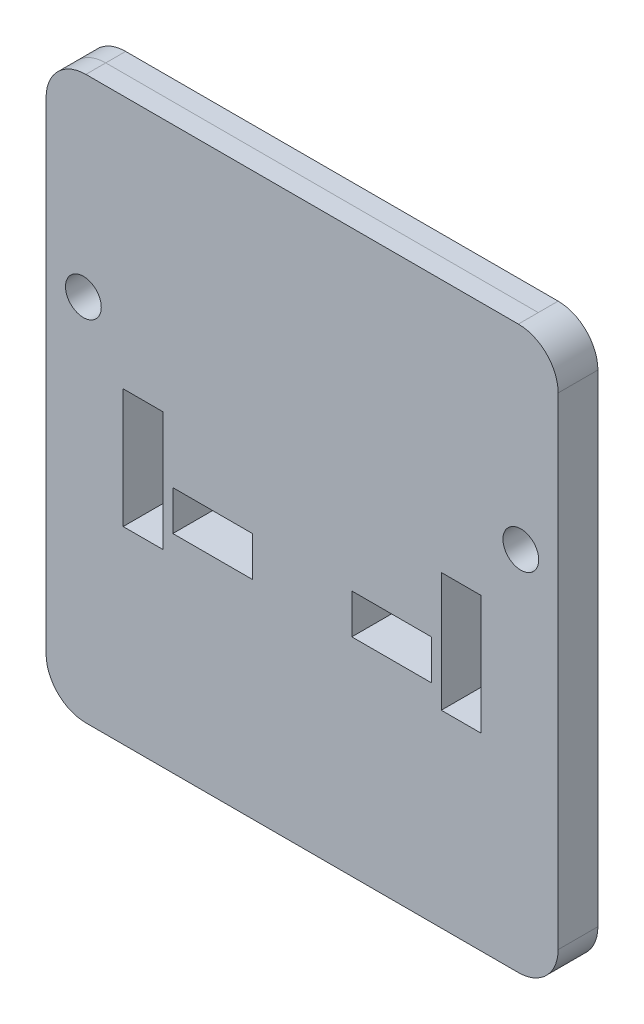
ISO-10303-21;
HEADER;
FILE_DESCRIPTION(('STEP AP214'),'2;1');
FILE_NAME('part.step','',(''),(''),'','','');
FILE_SCHEMA(('AUTOMOTIVE_DESIGN { 1 0 10303 214 1 1 1 1 }'));
ENDSEC;
DATA;
#1=APPLICATION_CONTEXT('core data for automotive mechanical design processes');
#2=APPLICATION_PROTOCOL_DEFINITION('international standard','automotive_design',2000,#1);
#3=PRODUCT_CONTEXT('',#1,'mechanical');
#4=PRODUCT('Part','Part','',(#3));
#5=PRODUCT_RELATED_PRODUCT_CATEGORY('part','',(#4));
#6=PRODUCT_DEFINITION_FORMATION('','',#4);
#7=PRODUCT_DEFINITION_CONTEXT('part definition',#1,'design');
#8=PRODUCT_DEFINITION('design','',#6,#7);
#9=PRODUCT_DEFINITION_SHAPE('','',#8);
#10=(LENGTH_UNIT() NAMED_UNIT(*) SI_UNIT(.MILLI.,.METRE.));
#11=(NAMED_UNIT(*) PLANE_ANGLE_UNIT() SI_UNIT($,.RADIAN.));
#12=(NAMED_UNIT(*) SI_UNIT($,.STERADIAN.) SOLID_ANGLE_UNIT());
#13=UNCERTAINTY_MEASURE_WITH_UNIT(LENGTH_MEASURE(1.E-05),#10,'distance_accuracy_value','');
#14=(GEOMETRIC_REPRESENTATION_CONTEXT(3) GLOBAL_UNCERTAINTY_ASSIGNED_CONTEXT((#13)) GLOBAL_UNIT_ASSIGNED_CONTEXT((#10,
#11,#12)) REPRESENTATION_CONTEXT('',''));
#15=CARTESIAN_POINT('',(0.,0.,0.));
#16=DIRECTION('',(0.,0.,1.));
#17=DIRECTION('',(1.,0.,0.));
#18=AXIS2_PLACEMENT_3D('',#15,#16,#17);
#19=CARTESIAN_POINT('',(-138.113003809,-179.355296356,25.4));
#20=DIRECTION('',(0.,1.,0.));
#21=DIRECTION('',(0.,0.,1.));
#22=AXIS2_PLACEMENT_3D('',#19,#20,#21);
#23=PLANE('',#22);
#24=DIRECTION('',(0.,0.,-1.));
#25=VECTOR('',#24,1.);
#26=CARTESIAN_POINT('',(-138.113003809,-179.355296356,25.4));
#27=LINE('',#26,#25);
#28=CARTESIAN_POINT('',(-138.113003809,-179.355296356,25.4));
#29=VERTEX_POINT('',#28);
#30=CARTESIAN_POINT('',(-138.113003809,-179.355296356,12.7));
#31=VERTEX_POINT('',#30);
#32=EDGE_CURVE('E430',#29,#31,#27,.T.);
#33=ORIENTED_EDGE('',*,*,#32,.T.);
#34=DIRECTION('',(1.,0.,0.));
#35=VECTOR('',#34,1.);
#36=CARTESIAN_POINT('',(-138.113003809,-179.355296356,12.7));
#37=LINE('',#36,#35);
#38=CARTESIAN_POINT('',(138.113003809,-179.355296356,12.7));
#39=VERTEX_POINT('',#38);
#40=EDGE_CURVE('E12',#31,#39,#37,.T.);
#41=ORIENTED_EDGE('',*,*,#40,.T.);
#42=DIRECTION('',(0.,0.,-1.));
#43=VECTOR('',#42,1.);
#44=CARTESIAN_POINT('',(138.113003809,-179.355296356,25.4));
#45=LINE('',#44,#43);
#46=CARTESIAN_POINT('',(138.113003809,-179.355296356,25.4));
#47=VERTEX_POINT('',#46);
#48=EDGE_CURVE('E426',#47,#39,#45,.T.);
#49=ORIENTED_EDGE('',*,*,#48,.F.);
#50=DIRECTION('',(1.,0.,0.));
#51=VECTOR('',#50,1.);
#52=CARTESIAN_POINT('',(-138.113003809,-179.355296356,25.4));
#53=LINE('',#52,#51);
#54=EDGE_CURVE('E368',#29,#47,#53,.T.);
#55=ORIENTED_EDGE('',*,*,#54,.F.);
#56=EDGE_LOOP('',(#33,#41,#49,#55));
#57=FACE_BOUND('',#56,.T.);
#58=ADVANCED_FACE('F40',(#57),#23,.F.);
#59=CARTESIAN_POINT('',(-138.113003809,-153.955296356,25.4));
#60=DIRECTION('',(0.,0.,-1.));
#61=DIRECTION('',(-1.,0.,0.));
#62=AXIS2_PLACEMENT_3D('',#59,#60,#61);
#63=CYLINDRICAL_SURFACE('',#62,25.4);
#64=DIRECTION('',(0.,0.,-1.));
#65=VECTOR('',#64,1.);
#66=CARTESIAN_POINT('',(-163.513003809,-153.955296356,25.4));
#67=LINE('',#66,#65);
#68=CARTESIAN_POINT('',(-163.513003809,-153.955296356,25.4));
#69=VERTEX_POINT('',#68);
#70=CARTESIAN_POINT('',(-163.513003809,-153.955296356,12.7));
#71=VERTEX_POINT('',#70);
#72=EDGE_CURVE('E404',#69,#71,#67,.T.);
#73=ORIENTED_EDGE('',*,*,#72,.T.);
#74=CARTESIAN_POINT('',(-138.113003809,-153.955296356,12.7));
#75=DIRECTION('',(0.,0.,1.));
#76=DIRECTION('',(1.,0.,0.));
#77=AXIS2_PLACEMENT_3D('',#74,#75,#76);
#78=CIRCLE('',#77,25.4);
#79=EDGE_CURVE('E48',#71,#31,#78,.T.);
#80=ORIENTED_EDGE('',*,*,#79,.T.);
#81=ORIENTED_EDGE('',*,*,#32,.F.);
#82=CARTESIAN_POINT('',(-138.113003809,-153.955296356,25.4));
#83=DIRECTION('',(0.,0.,1.));
#84=DIRECTION('',(-1.,0.,0.));
#85=AXIS2_PLACEMENT_3D('',#82,#83,#84);
#86=CIRCLE('',#85,25.4);
#87=EDGE_CURVE('E365',#69,#29,#86,.T.);
#88=ORIENTED_EDGE('',*,*,#87,.F.);
#89=EDGE_LOOP('',(#73,#80,#81,#88));
#90=FACE_BOUND('',#89,.T.);
#91=ADVANCED_FACE('F444',(#90),#63,.T.);
#92=CARTESIAN_POINT('',(-138.113003809,153.955296356,25.4));
#93=DIRECTION('',(0.,0.,-1.));
#94=DIRECTION('',(-1.,0.,0.));
#95=AXIS2_PLACEMENT_3D('',#92,#93,#94);
#96=CYLINDRICAL_SURFACE('',#95,25.4);
#97=DIRECTION('',(0.,0.,-1.));
#98=VECTOR('',#97,1.);
#99=CARTESIAN_POINT('',(-138.113003809,179.355296356,25.4));
#100=LINE('',#99,#98);
#101=CARTESIAN_POINT('',(-138.113003809,179.355296356,25.4));
#102=VERTEX_POINT('',#101);
#103=CARTESIAN_POINT('',(-138.113003809,179.355296356,12.7));
#104=VERTEX_POINT('',#103);
#105=EDGE_CURVE('E412',#102,#104,#100,.T.);
#106=ORIENTED_EDGE('',*,*,#105,.T.);
#107=CARTESIAN_POINT('',(-138.113003809,153.955296356,12.7));
#108=DIRECTION('',(0.,0.,1.));
#109=DIRECTION('',(1.,0.,0.));
#110=AXIS2_PLACEMENT_3D('',#107,#108,#109);
#111=CIRCLE('',#110,25.4);
#112=CARTESIAN_POINT('',(-163.513003809,153.955296356,12.7));
#113=VERTEX_POINT('',#112);
#114=EDGE_CURVE('E439',#104,#113,#111,.T.);
#115=ORIENTED_EDGE('',*,*,#114,.T.);
#116=DIRECTION('',(0.,0.,-1.));
#117=VECTOR('',#116,1.);
#118=CARTESIAN_POINT('',(-163.513003809,153.955296356,25.4));
#119=LINE('',#118,#117);
#120=CARTESIAN_POINT('',(-163.513003809,153.955296356,25.4));
#121=VERTEX_POINT('',#120);
#122=EDGE_CURVE('E408',#121,#113,#119,.T.);
#123=ORIENTED_EDGE('',*,*,#122,.F.);
#124=CARTESIAN_POINT('',(-138.113003809,153.955296356,25.4));
#125=DIRECTION('',(0.,0.,1.));
#126=DIRECTION('',(-1.,0.,0.));
#127=AXIS2_PLACEMENT_3D('',#124,#125,#126);
#128=CIRCLE('',#127,25.4);
#129=EDGE_CURVE('E379',#102,#121,#128,.T.);
#130=ORIENTED_EDGE('',*,*,#129,.F.);
#131=EDGE_LOOP('',(#106,#115,#123,#130));
#132=FACE_BOUND('',#131,.T.);
#133=ADVANCED_FACE('F494',(#132),#96,.T.);
#134=CARTESIAN_POINT('',(-163.513003809,-153.955296356,25.4));
#135=DIRECTION('',(1.,0.,0.));
#136=DIRECTION('',(0.,0.,-1.));
#137=AXIS2_PLACEMENT_3D('',#134,#135,#136);
#138=PLANE('',#137);
#139=ORIENTED_EDGE('',*,*,#122,.T.);
#140=DIRECTION('',(0.,-1.,0.));
#141=VECTOR('',#140,1.);
#142=CARTESIAN_POINT('',(-163.513003809,-153.955296356,12.7));
#143=LINE('',#142,#141);
#144=EDGE_CURVE('E436',#113,#71,#143,.T.);
#145=ORIENTED_EDGE('',*,*,#144,.T.);
#146=ORIENTED_EDGE('',*,*,#72,.F.);
#147=DIRECTION('',(0.,-1.,0.));
#148=VECTOR('',#147,1.);
#149=CARTESIAN_POINT('',(-163.513003809,-153.955296356,25.4));
#150=LINE('',#149,#148);
#151=EDGE_CURVE('E381',#121,#69,#150,.T.);
#152=ORIENTED_EDGE('',*,*,#151,.F.);
#153=EDGE_LOOP('',(#139,#145,#146,#152));
#154=FACE_BOUND('',#153,.T.);
#155=ADVANCED_FACE('F461',(#154),#138,.F.);
#156=CARTESIAN_POINT('',(-138.113003809,179.355296356,25.4));
#157=DIRECTION('',(0.,-1.,0.));
#158=DIRECTION('',(0.,0.,-1.));
#159=AXIS2_PLACEMENT_3D('',#156,#157,#158);
#160=PLANE('',#159);
#161=DIRECTION('',(0.,0.,-1.));
#162=VECTOR('',#161,1.);
#163=CARTESIAN_POINT('',(138.113003809,179.355296356,25.4));
#164=LINE('',#163,#162);
#165=CARTESIAN_POINT('',(138.113003809,179.355296356,25.4));
#166=VERTEX_POINT('',#165);
#167=CARTESIAN_POINT('',(138.113003809,179.355296356,12.7));
#168=VERTEX_POINT('',#167);
#169=EDGE_CURVE('E416',#166,#168,#164,.T.);
#170=ORIENTED_EDGE('',*,*,#169,.T.);
#171=DIRECTION('',(-1.,0.,0.));
#172=VECTOR('',#171,1.);
#173=CARTESIAN_POINT('',(-138.113003809,179.355296356,12.7));
#174=LINE('',#173,#172);
#175=EDGE_CURVE('E433',#168,#104,#174,.T.);
#176=ORIENTED_EDGE('',*,*,#175,.T.);
#177=ORIENTED_EDGE('',*,*,#105,.F.);
#178=DIRECTION('',(-1.,0.,0.));
#179=VECTOR('',#178,1.);
#180=CARTESIAN_POINT('',(-138.113003809,179.355296356,25.4));
#181=LINE('',#180,#179);
#182=EDGE_CURVE('E377',#166,#102,#181,.T.);
#183=ORIENTED_EDGE('',*,*,#182,.F.);
#184=EDGE_LOOP('',(#170,#176,#177,#183));
#185=FACE_BOUND('',#184,.T.);
#186=ADVANCED_FACE('F491',(#185),#160,.F.);
#187=CARTESIAN_POINT('',(-138.113003809,-153.955296356,25.4));
#188=DIRECTION('',(0.,0.,-1.));
#189=DIRECTION('',(-1.,0.,0.));
#190=AXIS2_PLACEMENT_3D('',#187,#188,#189);
#191=PLANE('',#190);
#192=DIRECTION('',(0.,-1.,0.));
#193=VECTOR('',#192,1.);
#194=CARTESIAN_POINT('',(114.3,17.3557557379995,25.4));
#195=LINE('',#194,#193);
#196=CARTESIAN_POINT('',(114.3,17.3557557379995,25.4));
#197=VERTEX_POINT('',#196);
#198=CARTESIAN_POINT('',(114.3,-58.8442442620005,25.4));
#199=VERTEX_POINT('',#198);
#200=EDGE_CURVE('E230',#197,#199,#195,.T.);
#201=ORIENTED_EDGE('',*,*,#200,.T.);
#202=DIRECTION('',(-1.,0.,0.));
#203=VECTOR('',#202,1.);
#204=CARTESIAN_POINT('',(114.3,-58.8442442620005,25.4));
#205=LINE('',#204,#203);
#206=CARTESIAN_POINT('',(88.9000000000001,-58.8442442620005,25.4));
#207=VERTEX_POINT('',#206);
#208=EDGE_CURVE('E222',#199,#207,#205,.T.);
#209=ORIENTED_EDGE('',*,*,#208,.T.);
#210=DIRECTION('',(0.,1.,0.));
#211=VECTOR('',#210,1.);
#212=CARTESIAN_POINT('',(88.9000000000001,-58.8442442620005,25.4));
#213=LINE('',#212,#211);
#214=CARTESIAN_POINT('',(88.9000000000001,17.3557557379995,25.4));
#215=VERTEX_POINT('',#214);
#216=EDGE_CURVE('E233',#207,#215,#213,.T.);
#217=ORIENTED_EDGE('',*,*,#216,.T.);
#218=DIRECTION('',(1.,0.,0.));
#219=VECTOR('',#218,1.);
#220=CARTESIAN_POINT('',(88.9000000000001,17.3557557379995,25.4));
#221=LINE('',#220,#219);
#222=EDGE_CURVE('E55',#215,#197,#221,.T.);
#223=ORIENTED_EDGE('',*,*,#222,.T.);
#224=EDGE_LOOP('',(#201,#209,#217,#223));
#225=FACE_BOUND('',#224,.T.);
#226=DIRECTION('',(0.,-1.,0.));
#227=VECTOR('',#226,1.);
#228=CARTESIAN_POINT('',(-88.8999999999999,17.3557557379998,25.4));
#229=LINE('',#228,#227);
#230=CARTESIAN_POINT('',(-88.8999999999999,17.3557557379998,25.4));
#231=VERTEX_POINT('',#230);
#232=CARTESIAN_POINT('',(-88.8999999999999,-58.8442442620002,25.4));
#233=VERTEX_POINT('',#232);
#234=EDGE_CURVE('E263',#231,#233,#229,.T.);
#235=ORIENTED_EDGE('',*,*,#234,.T.);
#236=DIRECTION('',(-1.,0.,0.));
#237=VECTOR('',#236,1.);
#238=CARTESIAN_POINT('',(-88.8999999999999,-58.8442442620002,25.4));
#239=LINE('',#238,#237);
#240=CARTESIAN_POINT('',(-114.3,-58.8442442620002,25.4));
#241=VERTEX_POINT('',#240);
#242=EDGE_CURVE('E274',#233,#241,#239,.T.);
#243=ORIENTED_EDGE('',*,*,#242,.T.);
#244=DIRECTION('',(0.,1.,0.));
#245=VECTOR('',#244,1.);
#246=CARTESIAN_POINT('',(-114.3,-58.8442442620002,25.4));
#247=LINE('',#246,#245);
#248=CARTESIAN_POINT('',(-114.3,17.3557557379998,25.4));
#249=VERTEX_POINT('',#248);
#250=EDGE_CURVE('E284',#241,#249,#247,.T.);
#251=ORIENTED_EDGE('',*,*,#250,.T.);
#252=DIRECTION('',(1.,0.,0.));
#253=VECTOR('',#252,1.);
#254=CARTESIAN_POINT('',(-114.3,17.3557557379998,25.4));
#255=LINE('',#254,#253);
#256=EDGE_CURVE('E63',#249,#231,#255,.T.);
#257=ORIENTED_EDGE('',*,*,#256,.T.);
#258=EDGE_LOOP('',(#235,#243,#251,#257));
#259=FACE_BOUND('',#258,.T.);
#260=DIRECTION('',(1.,0.,0.));
#261=VECTOR('',#260,1.);
#262=CARTESIAN_POINT('',(31.7500000000001,-21.4341674440001,25.4));
#263=LINE('',#262,#261);
#264=CARTESIAN_POINT('',(31.7500000000001,-21.4341674440001,25.4));
#265=VERTEX_POINT('',#264);
#266=CARTESIAN_POINT('',(82.5500000000001,-21.4341674440001,25.4));
#267=VERTEX_POINT('',#266);
#268=EDGE_CURVE('E299',#265,#267,#263,.T.);
#269=ORIENTED_EDGE('',*,*,#268,.T.);
#270=DIRECTION('',(0.,-1.,0.));
#271=VECTOR('',#270,1.);
#272=CARTESIAN_POINT('',(82.5500000000001,-21.4341674440001,25.4));
#273=LINE('',#272,#271);
#274=CARTESIAN_POINT('',(82.5500000000001,-46.8341674440001,25.4));
#275=VERTEX_POINT('',#274);
#276=EDGE_CURVE('E289',#267,#275,#273,.T.);
#277=ORIENTED_EDGE('',*,*,#276,.T.);
#278=DIRECTION('',(-1.,0.,0.));
#279=VECTOR('',#278,1.);
#280=CARTESIAN_POINT('',(82.5500000000001,-46.8341674440001,25.4));
#281=LINE('',#280,#279);
#282=CARTESIAN_POINT('',(31.7500000000001,-46.8341674440001,25.4));
#283=VERTEX_POINT('',#282);
#284=EDGE_CURVE('E292',#275,#283,#281,.T.);
#285=ORIENTED_EDGE('',*,*,#284,.T.);
#286=DIRECTION('',(0.,1.,0.));
#287=VECTOR('',#286,1.);
#288=CARTESIAN_POINT('',(31.7500000000001,-46.8341674440001,25.4));
#289=LINE('',#288,#287);
#290=EDGE_CURVE('E296',#283,#265,#289,.T.);
#291=ORIENTED_EDGE('',*,*,#290,.T.);
#292=EDGE_LOOP('',(#269,#277,#285,#291));
#293=FACE_BOUND('',#292,.T.);
#294=DIRECTION('',(1.,0.,0.));
#295=VECTOR('',#294,1.);
#296=CARTESIAN_POINT('',(-82.5499999999999,-21.4341674440001,25.4));
#297=LINE('',#296,#295);
#298=CARTESIAN_POINT('',(-82.5499999999999,-21.4341674440001,25.4));
#299=VERTEX_POINT('',#298);
#300=CARTESIAN_POINT('',(-31.7499999999999,-21.4341674440001,25.4));
#301=VERTEX_POINT('',#300);
#302=EDGE_CURVE('E326',#299,#301,#297,.T.);
#303=ORIENTED_EDGE('',*,*,#302,.T.);
#304=DIRECTION('',(0.,-1.,0.));
#305=VECTOR('',#304,1.);
#306=CARTESIAN_POINT('',(-31.7499999999999,-21.4341674440001,25.4));
#307=LINE('',#306,#305);
#308=CARTESIAN_POINT('',(-31.7499999999999,-46.8341674440001,25.4));
#309=VERTEX_POINT('',#308);
#310=EDGE_CURVE('E336',#301,#309,#307,.T.);
#311=ORIENTED_EDGE('',*,*,#310,.T.);
#312=DIRECTION('',(-1.,0.,0.));
#313=VECTOR('',#312,1.);
#314=CARTESIAN_POINT('',(-31.7499999999999,-46.8341674440001,25.4));
#315=LINE('',#314,#313);
#316=CARTESIAN_POINT('',(-82.5499999999999,-46.8341674440001,25.4));
#317=VERTEX_POINT('',#316);
#318=EDGE_CURVE('E348',#309,#317,#315,.T.);
#319=ORIENTED_EDGE('',*,*,#318,.T.);
#320=DIRECTION('',(0.,1.,0.));
#321=VECTOR('',#320,1.);
#322=CARTESIAN_POINT('',(-82.5499999999999,-46.8341674440001,25.4));
#323=LINE('',#322,#321);
#324=EDGE_CURVE('E345',#317,#299,#323,.T.);
#325=ORIENTED_EDGE('',*,*,#324,.T.);
#326=EDGE_LOOP('',(#303,#311,#319,#325));
#327=FACE_BOUND('',#326,.T.);
#328=ORIENTED_EDGE('',*,*,#87,.T.);
#329=ORIENTED_EDGE('',*,*,#54,.T.);
#330=CARTESIAN_POINT('',(138.113003809,-153.955296356,25.4));
#331=DIRECTION('',(0.,0.,1.));
#332=DIRECTION('',(1.,0.,0.));
#333=AXIS2_PLACEMENT_3D('',#330,#331,#332);
#334=CIRCLE('',#333,25.4);
#335=CARTESIAN_POINT('',(163.513003809,-153.955296356,25.4));
#336=VERTEX_POINT('',#335);
#337=EDGE_CURVE('E371',#47,#336,#334,.T.);
#338=ORIENTED_EDGE('',*,*,#337,.T.);
#339=DIRECTION('',(0.,1.,0.));
#340=VECTOR('',#339,1.);
#341=CARTESIAN_POINT('',(163.513003809,-153.955296356,25.4));
#342=LINE('',#341,#340);
#343=CARTESIAN_POINT('',(163.513003809,153.955296356,25.4));
#344=VERTEX_POINT('',#343);
#345=EDGE_CURVE('E373',#336,#344,#342,.T.);
#346=ORIENTED_EDGE('',*,*,#345,.T.);
#347=CARTESIAN_POINT('',(138.113003809,153.955296356,25.4));
#348=DIRECTION('',(0.,0.,1.));
#349=DIRECTION('',(-1.,0.,0.));
#350=AXIS2_PLACEMENT_3D('',#347,#348,#349);
#351=CIRCLE('',#350,25.4);
#352=EDGE_CURVE('E375',#344,#166,#351,.T.);
#353=ORIENTED_EDGE('',*,*,#352,.T.);
#354=ORIENTED_EDGE('',*,*,#182,.T.);
#355=ORIENTED_EDGE('',*,*,#129,.T.);
#356=ORIENTED_EDGE('',*,*,#151,.T.);
#357=EDGE_LOOP('',(#328,#329,#338,#346,#353,#354,#355,#356));
#358=FACE_BOUND('',#357,.T.);
#359=CARTESIAN_POINT('',(-139.7,55.455755738,25.4));
#360=DIRECTION('',(0.,0.,1.));
#361=DIRECTION('',(1.,0.,0.));
#362=AXIS2_PLACEMENT_3D('',#359,#360,#361);
#363=CIRCLE('',#362,11.422);
#364=CARTESIAN_POINT('',(-128.278,55.455755738,25.4));
#365=VERTEX_POINT('',#364);
#366=EDGE_CURVE('E359',#365,#365,#363,.T.);
#367=ORIENTED_EDGE('',*,*,#366,.F.);
#368=EDGE_LOOP('',(#367));
#369=FACE_BOUND('',#368,.T.);
#370=CARTESIAN_POINT('',(139.7,55.455755738,25.4));
#371=DIRECTION('',(0.,0.,1.));
#372=DIRECTION('',(1.,0.,0.));
#373=AXIS2_PLACEMENT_3D('',#370,#371,#372);
#374=CIRCLE('',#373,11.422);
#375=CARTESIAN_POINT('',(151.122,55.455755738,25.4));
#376=VERTEX_POINT('',#375);
#377=EDGE_CURVE('E353',#376,#376,#374,.T.);
#378=ORIENTED_EDGE('',*,*,#377,.F.);
#379=EDGE_LOOP('',(#378));
#380=FACE_BOUND('',#379,.T.);
#381=ADVANCED_FACE('F237',(#225,#259,#293,#327,#358,#369,#380),#191,.F.);
#382=CARTESIAN_POINT('',(-138.113003809,-153.955296356,0.));
#383=DIRECTION('',(0.,0.,-1.));
#384=DIRECTION('',(-1.,0.,0.));
#385=AXIS2_PLACEMENT_3D('',#382,#383,#384);
#386=PLANE('',#385);
#387=DIRECTION('',(-1.,0.,0.));
#388=VECTOR('',#387,1.);
#389=CARTESIAN_POINT('',(114.3,-58.8442442620005,0.));
#390=LINE('',#389,#388);
#391=CARTESIAN_POINT('',(114.3,-58.8442442620005,0.));
#392=VERTEX_POINT('',#391);
#393=CARTESIAN_POINT('',(88.9000000000001,-58.8442442620005,0.));
#394=VERTEX_POINT('',#393);
#395=EDGE_CURVE('E225',#392,#394,#390,.T.);
#396=ORIENTED_EDGE('',*,*,#395,.F.);
#397=DIRECTION('',(0.,-1.,0.));
#398=VECTOR('',#397,1.);
#399=CARTESIAN_POINT('',(114.3,17.3557557379995,0.));
#400=LINE('',#399,#398);
#401=CARTESIAN_POINT('',(114.3,17.3557557379995,0.));
#402=VERTEX_POINT('',#401);
#403=EDGE_CURVE('E240',#402,#392,#400,.T.);
#404=ORIENTED_EDGE('',*,*,#403,.F.);
#405=DIRECTION('',(1.,0.,0.));
#406=VECTOR('',#405,1.);
#407=CARTESIAN_POINT('',(88.9000000000001,17.3557557379995,0.));
#408=LINE('',#407,#406);
#409=CARTESIAN_POINT('',(88.9000000000001,17.3557557379995,0.));
#410=VERTEX_POINT('',#409);
#411=EDGE_CURVE('E243',#410,#402,#408,.T.);
#412=ORIENTED_EDGE('',*,*,#411,.F.);
#413=DIRECTION('',(0.,1.,0.));
#414=VECTOR('',#413,1.);
#415=CARTESIAN_POINT('',(88.9000000000001,-58.8442442620005,0.));
#416=LINE('',#415,#414);
#417=EDGE_CURVE('E249',#394,#410,#416,.T.);
#418=ORIENTED_EDGE('',*,*,#417,.F.);
#419=EDGE_LOOP('',(#396,#404,#412,#418));
#420=FACE_BOUND('',#419,.T.);
#421=DIRECTION('',(-1.,0.,0.));
#422=VECTOR('',#421,1.);
#423=CARTESIAN_POINT('',(-88.8999999999999,-58.8442442620002,0.));
#424=LINE('',#423,#422);
#425=CARTESIAN_POINT('',(-88.8999999999999,-58.8442442620002,0.));
#426=VERTEX_POINT('',#425);
#427=CARTESIAN_POINT('',(-114.3,-58.8442442620002,0.));
#428=VERTEX_POINT('',#427);
#429=EDGE_CURVE('E250',#426,#428,#424,.T.);
#430=ORIENTED_EDGE('',*,*,#429,.F.);
#431=DIRECTION('',(0.,-1.,0.));
#432=VECTOR('',#431,1.);
#433=CARTESIAN_POINT('',(-88.8999999999999,17.3557557379998,0.));
#434=LINE('',#433,#432);
#435=CARTESIAN_POINT('',(-88.8999999999999,17.3557557379998,0.));
#436=VERTEX_POINT('',#435);
#437=EDGE_CURVE('E270',#436,#426,#434,.T.);
#438=ORIENTED_EDGE('',*,*,#437,.F.);
#439=DIRECTION('',(1.,0.,0.));
#440=VECTOR('',#439,1.);
#441=CARTESIAN_POINT('',(-114.3,17.3557557379998,0.));
#442=LINE('',#441,#440);
#443=CARTESIAN_POINT('',(-114.3,17.3557557379998,0.));
#444=VERTEX_POINT('',#443);
#445=EDGE_CURVE('E273',#444,#436,#442,.T.);
#446=ORIENTED_EDGE('',*,*,#445,.F.);
#447=DIRECTION('',(0.,1.,0.));
#448=VECTOR('',#447,1.);
#449=CARTESIAN_POINT('',(-114.3,-58.8442442620002,0.));
#450=LINE('',#449,#448);
#451=EDGE_CURVE('E277',#428,#444,#450,.T.);
#452=ORIENTED_EDGE('',*,*,#451,.F.);
#453=EDGE_LOOP('',(#430,#438,#446,#452));
#454=FACE_BOUND('',#453,.T.);
#455=DIRECTION('',(0.,-1.,0.));
#456=VECTOR('',#455,1.);
#457=CARTESIAN_POINT('',(82.5500000000001,-21.4341674440001,0.));
#458=LINE('',#457,#456);
#459=CARTESIAN_POINT('',(82.5500000000001,-21.4341674440001,0.));
#460=VERTEX_POINT('',#459);
#461=CARTESIAN_POINT('',(82.5500000000001,-46.8341674440001,0.));
#462=VERTEX_POINT('',#461);
#463=EDGE_CURVE('E303',#460,#462,#458,.T.);
#464=ORIENTED_EDGE('',*,*,#463,.F.);
#465=DIRECTION('',(1.,0.,0.));
#466=VECTOR('',#465,1.);
#467=CARTESIAN_POINT('',(31.7500000000001,-21.4341674440001,0.));
#468=LINE('',#467,#466);
#469=CARTESIAN_POINT('',(31.7500000000001,-21.4341674440001,0.));
#470=VERTEX_POINT('',#469);
#471=EDGE_CURVE('E293',#470,#460,#468,.T.);
#472=ORIENTED_EDGE('',*,*,#471,.F.);
#473=DIRECTION('',(0.,1.,0.));
#474=VECTOR('',#473,1.);
#475=CARTESIAN_POINT('',(31.7500000000001,-46.8341674440001,0.));
#476=LINE('',#475,#474);
#477=CARTESIAN_POINT('',(31.7500000000001,-46.8341674440001,0.));
#478=VERTEX_POINT('',#477);
#479=EDGE_CURVE('E309',#478,#470,#476,.T.);
#480=ORIENTED_EDGE('',*,*,#479,.F.);
#481=DIRECTION('',(-1.,0.,0.));
#482=VECTOR('',#481,1.);
#483=CARTESIAN_POINT('',(82.5500000000001,-46.8341674440001,0.));
#484=LINE('',#483,#482);
#485=EDGE_CURVE('E305',#462,#478,#484,.T.);
#486=ORIENTED_EDGE('',*,*,#485,.F.);
#487=EDGE_LOOP('',(#464,#472,#480,#486));
#488=FACE_BOUND('',#487,.T.);
#489=DIRECTION('',(0.,-1.,0.));
#490=VECTOR('',#489,1.);
#491=CARTESIAN_POINT('',(-31.7499999999999,-21.4341674440001,0.));
#492=LINE('',#491,#490);
#493=CARTESIAN_POINT('',(-31.7499999999999,-21.4341674440001,0.));
#494=VERTEX_POINT('',#493);
#495=CARTESIAN_POINT('',(-31.7499999999999,-46.8341674440001,0.));
#496=VERTEX_POINT('',#495);
#497=EDGE_CURVE('E306',#494,#496,#492,.T.);
#498=ORIENTED_EDGE('',*,*,#497,.F.);
#499=DIRECTION('',(1.,0.,0.));
#500=VECTOR('',#499,1.);
#501=CARTESIAN_POINT('',(-82.5499999999999,-21.4341674440001,0.));
#502=LINE('',#501,#500);
#503=CARTESIAN_POINT('',(-82.5499999999999,-21.4341674440001,0.));
#504=VERTEX_POINT('',#503);
#505=EDGE_CURVE('E332',#504,#494,#502,.T.);
#506=ORIENTED_EDGE('',*,*,#505,.F.);
#507=DIRECTION('',(0.,1.,0.));
#508=VECTOR('',#507,1.);
#509=CARTESIAN_POINT('',(-82.5499999999999,-46.8341674440001,0.));
#510=LINE('',#509,#508);
#511=CARTESIAN_POINT('',(-82.5499999999999,-46.8341674440001,0.));
#512=VERTEX_POINT('',#511);
#513=EDGE_CURVE('E335',#512,#504,#510,.T.);
#514=ORIENTED_EDGE('',*,*,#513,.F.);
#515=DIRECTION('',(-1.,0.,0.));
#516=VECTOR('',#515,1.);
#517=CARTESIAN_POINT('',(-31.7499999999999,-46.8341674440001,0.));
#518=LINE('',#517,#516);
#519=EDGE_CURVE('E339',#496,#512,#518,.T.);
#520=ORIENTED_EDGE('',*,*,#519,.F.);
#521=EDGE_LOOP('',(#498,#506,#514,#520));
#522=FACE_BOUND('',#521,.T.);
#523=CARTESIAN_POINT('',(-139.7,55.455755738,0.));
#524=DIRECTION('',(0.,0.,1.));
#525=DIRECTION('',(1.,0.,0.));
#526=AXIS2_PLACEMENT_3D('',#523,#524,#525);
#527=CIRCLE('',#526,11.422);
#528=CARTESIAN_POINT('',(-128.278,55.455755738,0.));
#529=VERTEX_POINT('',#528);
#530=EDGE_CURVE('E356',#529,#529,#527,.T.);
#531=ORIENTED_EDGE('',*,*,#530,.T.);
#532=EDGE_LOOP('',(#531));
#533=FACE_BOUND('',#532,.T.);
#534=CARTESIAN_POINT('',(-138.113003809,-153.955296356,0.));
#535=DIRECTION('',(0.,0.,1.));
#536=DIRECTION('',(-1.,0.,0.));
#537=AXIS2_PLACEMENT_3D('',#534,#535,#536);
#538=CIRCLE('',#537,25.4);
#539=CARTESIAN_POINT('',(-163.513003809,-153.955296356,0.));
#540=VERTEX_POINT('',#539);
#541=CARTESIAN_POINT('',(-138.113003809,-179.355296356,0.));
#542=VERTEX_POINT('',#541);
#543=EDGE_CURVE('E362',#540,#542,#538,.T.);
#544=ORIENTED_EDGE('',*,*,#543,.F.);
#545=DIRECTION('',(0.,-1.,0.));
#546=VECTOR('',#545,1.);
#547=CARTESIAN_POINT('',(-163.513003809,-153.955296356,0.));
#548=LINE('',#547,#546);
#549=CARTESIAN_POINT('',(-163.513003809,153.955296356,0.));
#550=VERTEX_POINT('',#549);
#551=EDGE_CURVE('E369',#550,#540,#548,.T.);
#552=ORIENTED_EDGE('',*,*,#551,.F.);
#553=CARTESIAN_POINT('',(-138.113003809,153.955296356,0.));
#554=DIRECTION('',(0.,0.,1.));
#555=DIRECTION('',(-1.,0.,0.));
#556=AXIS2_PLACEMENT_3D('',#553,#554,#555);
#557=CIRCLE('',#556,25.4);
#558=CARTESIAN_POINT('',(-138.113003809,179.355296356,0.));
#559=VERTEX_POINT('',#558);
#560=EDGE_CURVE('E399',#559,#550,#557,.T.);
#561=ORIENTED_EDGE('',*,*,#560,.F.);
#562=DIRECTION('',(-1.,0.,0.));
#563=VECTOR('',#562,1.);
#564=CARTESIAN_POINT('',(-138.113003809,179.355296356,0.));
#565=LINE('',#564,#563);
#566=CARTESIAN_POINT('',(138.113003809,179.355296356,0.));
#567=VERTEX_POINT('',#566);
#568=EDGE_CURVE('E396',#567,#559,#565,.T.);
#569=ORIENTED_EDGE('',*,*,#568,.F.);
#570=CARTESIAN_POINT('',(138.113003809,153.955296356,0.));
#571=DIRECTION('',(0.,0.,1.));
#572=DIRECTION('',(-1.,0.,0.));
#573=AXIS2_PLACEMENT_3D('',#570,#571,#572);
#574=CIRCLE('',#573,25.4);
#575=CARTESIAN_POINT('',(163.513003809,153.955296356,0.));
#576=VERTEX_POINT('',#575);
#577=EDGE_CURVE('E393',#576,#567,#574,.T.);
#578=ORIENTED_EDGE('',*,*,#577,.F.);
#579=DIRECTION('',(0.,1.,0.));
#580=VECTOR('',#579,1.);
#581=CARTESIAN_POINT('',(163.513003809,-153.955296356,0.));
#582=LINE('',#581,#580);
#583=CARTESIAN_POINT('',(163.513003809,-153.955296356,0.));
#584=VERTEX_POINT('',#583);
#585=EDGE_CURVE('E391',#584,#576,#582,.T.);
#586=ORIENTED_EDGE('',*,*,#585,.F.);
#587=CARTESIAN_POINT('',(138.113003809,-153.955296356,0.));
#588=DIRECTION('',(0.,0.,1.));
#589=DIRECTION('',(1.,0.,0.));
#590=AXIS2_PLACEMENT_3D('',#587,#588,#589);
#591=CIRCLE('',#590,25.4);
#592=CARTESIAN_POINT('',(138.113003809,-179.355296356,0.));
#593=VERTEX_POINT('',#592);
#594=EDGE_CURVE('E389',#593,#584,#591,.T.);
#595=ORIENTED_EDGE('',*,*,#594,.F.);
#596=DIRECTION('',(1.,0.,0.));
#597=VECTOR('',#596,1.);
#598=CARTESIAN_POINT('',(-138.113003809,-179.355296356,0.));
#599=LINE('',#598,#597);
#600=EDGE_CURVE('E386',#542,#593,#599,.T.);
#601=ORIENTED_EDGE('',*,*,#600,.F.);
#602=EDGE_LOOP('',(#544,#552,#561,#569,#578,#586,#595,#601));
#603=FACE_BOUND('',#602,.T.);
#604=CARTESIAN_POINT('',(139.7,55.455755738,0.));
#605=DIRECTION('',(0.,0.,1.));
#606=DIRECTION('',(1.,0.,0.));
#607=AXIS2_PLACEMENT_3D('',#604,#605,#606);
#608=CIRCLE('',#607,11.422);
#609=CARTESIAN_POINT('',(151.122,55.455755738,0.));
#610=VERTEX_POINT('',#609);
#611=EDGE_CURVE('E316',#610,#610,#608,.T.);
#612=ORIENTED_EDGE('',*,*,#611,.T.);
#613=EDGE_LOOP('',(#612));
#614=FACE_BOUND('',#613,.T.);
#615=ADVANCED_FACE('F470',(#420,#454,#488,#522,#533,#603,#614),#386,.T.);
#616=ORIENTED_EDGE('',*,*,#79,.F.);
#617=EDGE_CURVE('E383',#71,#540,#67,.T.);
#618=ORIENTED_EDGE('',*,*,#617,.T.);
#619=ORIENTED_EDGE('',*,*,#543,.T.);
#620=EDGE_CURVE('E429',#31,#542,#27,.T.);
#621=ORIENTED_EDGE('',*,*,#620,.F.);
#622=EDGE_LOOP('',(#616,#618,#619,#621));
#623=FACE_BOUND('',#622,.T.);
#624=ADVANCED_FACE('F42',(#623),#63,.T.);
#625=ORIENTED_EDGE('',*,*,#40,.F.);
#626=ORIENTED_EDGE('',*,*,#620,.T.);
#627=ORIENTED_EDGE('',*,*,#600,.T.);
#628=EDGE_CURVE('E425',#39,#593,#45,.T.);
#629=ORIENTED_EDGE('',*,*,#628,.F.);
#630=EDGE_LOOP('',(#625,#626,#627,#629));
#631=FACE_BOUND('',#630,.T.);
#632=ADVANCED_FACE('F474',(#631),#23,.F.);
#633=CARTESIAN_POINT('',(138.113003809,-153.955296356,25.4));
#634=DIRECTION('',(0.,0.,-1.));
#635=DIRECTION('',(-1.,0.,0.));
#636=AXIS2_PLACEMENT_3D('',#633,#634,#635);
#637=CYLINDRICAL_SURFACE('',#636,25.4);
#638=ORIENTED_EDGE('',*,*,#594,.T.);
#639=DIRECTION('',(0.,0.,-1.));
#640=VECTOR('',#639,1.);
#641=CARTESIAN_POINT('',(163.513003809,-153.955296356,25.4));
#642=LINE('',#641,#640);
#643=EDGE_CURVE('E422',#336,#584,#642,.T.);
#644=ORIENTED_EDGE('',*,*,#643,.F.);
#645=ORIENTED_EDGE('',*,*,#337,.F.);
#646=ORIENTED_EDGE('',*,*,#48,.T.);
#647=ORIENTED_EDGE('',*,*,#628,.T.);
#648=EDGE_LOOP('',(#638,#644,#645,#646,#647));
#649=FACE_BOUND('',#648,.T.);
#650=ADVANCED_FACE('F476',(#649),#637,.T.);
#651=CARTESIAN_POINT('',(163.513003809,-153.955296356,25.4));
#652=DIRECTION('',(-1.,0.,0.));
#653=DIRECTION('',(0.,0.,1.));
#654=AXIS2_PLACEMENT_3D('',#651,#652,#653);
#655=PLANE('',#654);
#656=ORIENTED_EDGE('',*,*,#585,.T.);
#657=DIRECTION('',(0.,0.,-1.));
#658=VECTOR('',#657,1.);
#659=CARTESIAN_POINT('',(163.513003809,153.955296356,25.4));
#660=LINE('',#659,#658);
#661=EDGE_CURVE('E419',#344,#576,#660,.T.);
#662=ORIENTED_EDGE('',*,*,#661,.F.);
#663=ORIENTED_EDGE('',*,*,#345,.F.);
#664=ORIENTED_EDGE('',*,*,#643,.T.);
#665=EDGE_LOOP('',(#656,#662,#663,#664));
#666=FACE_BOUND('',#665,.T.);
#667=ADVANCED_FACE('F483',(#666),#655,.F.);
#668=CARTESIAN_POINT('',(138.113003809,153.955296356,25.4));
#669=DIRECTION('',(0.,0.,-1.));
#670=DIRECTION('',(-1.,0.,0.));
#671=AXIS2_PLACEMENT_3D('',#668,#669,#670);
#672=CYLINDRICAL_SURFACE('',#671,25.4);
#673=ORIENTED_EDGE('',*,*,#577,.T.);
#674=EDGE_CURVE('E415',#168,#567,#164,.T.);
#675=ORIENTED_EDGE('',*,*,#674,.F.);
#676=ORIENTED_EDGE('',*,*,#169,.F.);
#677=ORIENTED_EDGE('',*,*,#352,.F.);
#678=ORIENTED_EDGE('',*,*,#661,.T.);
#679=EDGE_LOOP('',(#673,#675,#676,#677,#678));
#680=FACE_BOUND('',#679,.T.);
#681=ADVANCED_FACE('F486',(#680),#672,.T.);
#682=ORIENTED_EDGE('',*,*,#175,.F.);
#683=ORIENTED_EDGE('',*,*,#674,.T.);
#684=ORIENTED_EDGE('',*,*,#568,.T.);
#685=EDGE_CURVE('E411',#104,#559,#100,.T.);
#686=ORIENTED_EDGE('',*,*,#685,.F.);
#687=EDGE_LOOP('',(#682,#683,#684,#686));
#688=FACE_BOUND('',#687,.T.);
#689=ADVANCED_FACE('F499',(#688),#160,.F.);
#690=ORIENTED_EDGE('',*,*,#114,.F.);
#691=ORIENTED_EDGE('',*,*,#685,.T.);
#692=ORIENTED_EDGE('',*,*,#560,.T.);
#693=EDGE_CURVE('E407',#113,#550,#119,.T.);
#694=ORIENTED_EDGE('',*,*,#693,.F.);
#695=EDGE_LOOP('',(#690,#691,#692,#694));
#696=FACE_BOUND('',#695,.T.);
#697=ADVANCED_FACE('F496',(#696),#96,.T.);
#698=ORIENTED_EDGE('',*,*,#144,.F.);
#699=ORIENTED_EDGE('',*,*,#693,.T.);
#700=ORIENTED_EDGE('',*,*,#551,.T.);
#701=ORIENTED_EDGE('',*,*,#617,.F.);
#702=EDGE_LOOP('',(#698,#699,#700,#701));
#703=FACE_BOUND('',#702,.T.);
#704=ADVANCED_FACE('F466',(#703),#138,.F.);
#705=CARTESIAN_POINT('',(-139.7,55.455755738,25.4));
#706=DIRECTION('',(0.,0.,-1.));
#707=DIRECTION('',(-1.,0.,0.));
#708=AXIS2_PLACEMENT_3D('',#705,#706,#707);
#709=CYLINDRICAL_SURFACE('',#708,11.422);
#710=ORIENTED_EDGE('',*,*,#366,.T.);
#711=EDGE_LOOP('',(#710));
#712=FACE_BOUND('',#711,.T.);
#713=ORIENTED_EDGE('',*,*,#530,.F.);
#714=EDGE_LOOP('',(#713));
#715=FACE_BOUND('',#714,.T.);
#716=ADVANCED_FACE('F534',(#712,#715),#709,.F.);
#717=CARTESIAN_POINT('',(139.7,55.455755738,25.4));
#718=DIRECTION('',(0.,0.,-1.));
#719=DIRECTION('',(-1.,0.,0.));
#720=AXIS2_PLACEMENT_3D('',#717,#718,#719);
#721=CYLINDRICAL_SURFACE('',#720,11.422);
#722=ORIENTED_EDGE('',*,*,#377,.T.);
#723=EDGE_LOOP('',(#722));
#724=FACE_BOUND('',#723,.T.);
#725=ORIENTED_EDGE('',*,*,#611,.F.);
#726=EDGE_LOOP('',(#725));
#727=FACE_BOUND('',#726,.T.);
#728=ADVANCED_FACE('F538',(#724,#727),#721,.F.);
#729=CARTESIAN_POINT('',(-31.7499999999999,-21.4341674440001,25.4));
#730=DIRECTION('',(1.,0.,0.));
#731=DIRECTION('',(0.,0.,-1.));
#732=AXIS2_PLACEMENT_3D('',#729,#730,#731);
#733=PLANE('',#732);
#734=ORIENTED_EDGE('',*,*,#497,.T.);
#735=DIRECTION('',(0.,0.,-1.));
#736=VECTOR('',#735,1.);
#737=CARTESIAN_POINT('',(-31.7499999999999,-46.8341674440001,25.4));
#738=LINE('',#737,#736);
#739=EDGE_CURVE('E323',#309,#496,#738,.T.);
#740=ORIENTED_EDGE('',*,*,#739,.F.);
#741=ORIENTED_EDGE('',*,*,#310,.F.);
#742=DIRECTION('',(0.,0.,-1.));
#743=VECTOR('',#742,1.);
#744=CARTESIAN_POINT('',(-31.7499999999999,-21.4341674440001,25.4));
#745=LINE('',#744,#743);
#746=EDGE_CURVE('E256',#301,#494,#745,.T.);
#747=ORIENTED_EDGE('',*,*,#746,.T.);
#748=EDGE_LOOP('',(#734,#740,#741,#747));
#749=FACE_BOUND('',#748,.T.);
#750=ADVANCED_FACE('F628',(#749),#733,.F.);
#751=CARTESIAN_POINT('',(-82.5499999999999,-21.4341674440001,25.4));
#752=DIRECTION('',(0.,1.,0.));
#753=DIRECTION('',(0.,0.,1.));
#754=AXIS2_PLACEMENT_3D('',#751,#752,#753);
#755=PLANE('',#754);
#756=ORIENTED_EDGE('',*,*,#505,.T.);
#757=ORIENTED_EDGE('',*,*,#746,.F.);
#758=ORIENTED_EDGE('',*,*,#302,.F.);
#759=DIRECTION('',(0.,0.,-1.));
#760=VECTOR('',#759,1.);
#761=CARTESIAN_POINT('',(-82.5499999999999,-21.4341674440001,25.4));
#762=LINE('',#761,#760);
#763=EDGE_CURVE('E329',#299,#504,#762,.T.);
#764=ORIENTED_EDGE('',*,*,#763,.T.);
#765=EDGE_LOOP('',(#756,#757,#758,#764));
#766=FACE_BOUND('',#765,.T.);
#767=ADVANCED_FACE('F618',(#766),#755,.F.);
#768=CARTESIAN_POINT('',(-82.5499999999999,-46.8341674440001,25.4));
#769=DIRECTION('',(-1.,0.,0.));
#770=DIRECTION('',(0.,0.,1.));
#771=AXIS2_PLACEMENT_3D('',#768,#769,#770);
#772=PLANE('',#771);
#773=ORIENTED_EDGE('',*,*,#513,.T.);
#774=ORIENTED_EDGE('',*,*,#763,.F.);
#775=ORIENTED_EDGE('',*,*,#324,.F.);
#776=DIRECTION('',(0.,0.,-1.));
#777=VECTOR('',#776,1.);
#778=CARTESIAN_POINT('',(-82.5499999999999,-46.8341674440001,25.4));
#779=LINE('',#778,#777);
#780=EDGE_CURVE('E327',#317,#512,#779,.T.);
#781=ORIENTED_EDGE('',*,*,#780,.T.);
#782=EDGE_LOOP('',(#773,#774,#775,#781));
#783=FACE_BOUND('',#782,.T.);
#784=ADVANCED_FACE('F608',(#783),#772,.F.);
#785=CARTESIAN_POINT('',(-31.7499999999999,-46.8341674440001,25.4));
#786=DIRECTION('',(0.,-1.,0.));
#787=DIRECTION('',(0.,0.,-1.));
#788=AXIS2_PLACEMENT_3D('',#785,#786,#787);
#789=PLANE('',#788);
#790=ORIENTED_EDGE('',*,*,#519,.T.);
#791=ORIENTED_EDGE('',*,*,#780,.F.);
#792=ORIENTED_EDGE('',*,*,#318,.F.);
#793=ORIENTED_EDGE('',*,*,#739,.T.);
#794=EDGE_LOOP('',(#790,#791,#792,#793));
#795=FACE_BOUND('',#794,.T.);
#796=ADVANCED_FACE('F598',(#795),#789,.F.);
#797=CARTESIAN_POINT('',(82.5500000000001,-21.4341674440001,25.4));
#798=DIRECTION('',(1.,0.,0.));
#799=DIRECTION('',(0.,0.,-1.));
#800=AXIS2_PLACEMENT_3D('',#797,#798,#799);
#801=PLANE('',#800);
#802=ORIENTED_EDGE('',*,*,#463,.T.);
#803=DIRECTION('',(0.,0.,-1.));
#804=VECTOR('',#803,1.);
#805=CARTESIAN_POINT('',(82.5500000000001,-46.8341674440001,25.4));
#806=LINE('',#805,#804);
#807=EDGE_CURVE('E302',#275,#462,#806,.T.);
#808=ORIENTED_EDGE('',*,*,#807,.F.);
#809=ORIENTED_EDGE('',*,*,#276,.F.);
#810=DIRECTION('',(0.,0.,-1.));
#811=VECTOR('',#810,1.);
#812=CARTESIAN_POINT('',(82.5500000000001,-21.4341674440001,25.4));
#813=LINE('',#812,#811);
#814=EDGE_CURVE('E314',#267,#460,#813,.T.);
#815=ORIENTED_EDGE('',*,*,#814,.T.);
#816=EDGE_LOOP('',(#802,#808,#809,#815));
#817=FACE_BOUND('',#816,.T.);
#818=ADVANCED_FACE('F588',(#817),#801,.F.);
#819=CARTESIAN_POINT('',(31.7500000000001,-21.4341674440001,25.4));
#820=DIRECTION('',(0.,1.,0.));
#821=DIRECTION('',(0.,0.,1.));
#822=AXIS2_PLACEMENT_3D('',#819,#820,#821);
#823=PLANE('',#822);
#824=ORIENTED_EDGE('',*,*,#471,.T.);
#825=ORIENTED_EDGE('',*,*,#814,.F.);
#826=ORIENTED_EDGE('',*,*,#268,.F.);
#827=DIRECTION('',(0.,0.,-1.));
#828=VECTOR('',#827,1.);
#829=CARTESIAN_POINT('',(31.7500000000001,-21.4341674440001,25.4));
#830=LINE('',#829,#828);
#831=EDGE_CURVE('E317',#265,#470,#830,.T.);
#832=ORIENTED_EDGE('',*,*,#831,.T.);
#833=EDGE_LOOP('',(#824,#825,#826,#832));
#834=FACE_BOUND('',#833,.T.);
#835=ADVANCED_FACE('F578',(#834),#823,.F.);
#836=CARTESIAN_POINT('',(31.7500000000001,-46.8341674440001,25.4));
#837=DIRECTION('',(-1.,0.,0.));
#838=DIRECTION('',(0.,0.,1.));
#839=AXIS2_PLACEMENT_3D('',#836,#837,#838);
#840=PLANE('',#839);
#841=ORIENTED_EDGE('',*,*,#479,.T.);
#842=ORIENTED_EDGE('',*,*,#831,.F.);
#843=ORIENTED_EDGE('',*,*,#290,.F.);
#844=DIRECTION('',(0.,0.,-1.));
#845=VECTOR('',#844,1.);
#846=CARTESIAN_POINT('',(31.7500000000001,-46.8341674440001,25.4));
#847=LINE('',#846,#845);
#848=EDGE_CURVE('E319',#283,#478,#847,.T.);
#849=ORIENTED_EDGE('',*,*,#848,.T.);
#850=EDGE_LOOP('',(#841,#842,#843,#849));
#851=FACE_BOUND('',#850,.T.);
#852=ADVANCED_FACE('F567',(#851),#840,.F.);
#853=CARTESIAN_POINT('',(82.5500000000001,-46.8341674440001,25.4));
#854=DIRECTION('',(0.,-1.,0.));
#855=DIRECTION('',(0.,0.,-1.));
#856=AXIS2_PLACEMENT_3D('',#853,#854,#855);
#857=PLANE('',#856);
#858=ORIENTED_EDGE('',*,*,#485,.T.);
#859=ORIENTED_EDGE('',*,*,#848,.F.);
#860=ORIENTED_EDGE('',*,*,#284,.F.);
#861=ORIENTED_EDGE('',*,*,#807,.T.);
#862=EDGE_LOOP('',(#858,#859,#860,#861));
#863=FACE_BOUND('',#862,.T.);
#864=ADVANCED_FACE('F561',(#863),#857,.F.);
#865=CARTESIAN_POINT('',(-88.8999999999999,-58.8442442620002,25.4));
#866=DIRECTION('',(0.,-1.,0.));
#867=DIRECTION('',(0.,0.,-1.));
#868=AXIS2_PLACEMENT_3D('',#865,#866,#867);
#869=PLANE('',#868);
#870=ORIENTED_EDGE('',*,*,#429,.T.);
#871=DIRECTION('',(0.,0.,-1.));
#872=VECTOR('',#871,1.);
#873=CARTESIAN_POINT('',(-114.3,-58.8442442620002,25.4));
#874=LINE('',#873,#872);
#875=EDGE_CURVE('E260',#241,#428,#874,.T.);
#876=ORIENTED_EDGE('',*,*,#875,.F.);
#877=ORIENTED_EDGE('',*,*,#242,.F.);
#878=DIRECTION('',(0.,0.,-1.));
#879=VECTOR('',#878,1.);
#880=CARTESIAN_POINT('',(-88.8999999999999,-58.8442442620002,25.4));
#881=LINE('',#880,#879);
#882=EDGE_CURVE('E268',#233,#426,#881,.T.);
#883=ORIENTED_EDGE('',*,*,#882,.T.);
#884=EDGE_LOOP('',(#870,#876,#877,#883));
#885=FACE_BOUND('',#884,.T.);
#886=ADVANCED_FACE('F566',(#885),#869,.F.);
#887=CARTESIAN_POINT('',(-88.8999999999999,17.3557557379998,25.4));
#888=DIRECTION('',(1.,0.,0.));
#889=DIRECTION('',(0.,0.,-1.));
#890=AXIS2_PLACEMENT_3D('',#887,#888,#889);
#891=PLANE('',#890);
#892=ORIENTED_EDGE('',*,*,#437,.T.);
#893=ORIENTED_EDGE('',*,*,#882,.F.);
#894=ORIENTED_EDGE('',*,*,#234,.F.);
#895=DIRECTION('',(0.,0.,-1.));
#896=VECTOR('',#895,1.);
#897=CARTESIAN_POINT('',(-88.8999999999999,17.3557557379998,25.4));
#898=LINE('',#897,#896);
#899=EDGE_CURVE('E266',#231,#436,#898,.T.);
#900=ORIENTED_EDGE('',*,*,#899,.T.);
#901=EDGE_LOOP('',(#892,#893,#894,#900));
#902=FACE_BOUND('',#901,.T.);
#903=ADVANCED_FACE('F713',(#902),#891,.F.);
#904=CARTESIAN_POINT('',(-114.3,17.3557557379998,25.4));
#905=DIRECTION('',(0.,1.,0.));
#906=DIRECTION('',(0.,0.,1.));
#907=AXIS2_PLACEMENT_3D('',#904,#905,#906);
#908=PLANE('',#907);
#909=ORIENTED_EDGE('',*,*,#445,.T.);
#910=ORIENTED_EDGE('',*,*,#899,.F.);
#911=ORIENTED_EDGE('',*,*,#256,.F.);
#912=DIRECTION('',(0.,0.,-1.));
#913=VECTOR('',#912,1.);
#914=CARTESIAN_POINT('',(-114.3,17.3557557379998,25.4));
#915=LINE('',#914,#913);
#916=EDGE_CURVE('E264',#249,#444,#915,.T.);
#917=ORIENTED_EDGE('',*,*,#916,.T.);
#918=EDGE_LOOP('',(#909,#910,#911,#917));
#919=FACE_BOUND('',#918,.T.);
#920=ADVANCED_FACE('F723',(#919),#908,.F.);
#921=CARTESIAN_POINT('',(-114.3,-58.8442442620002,25.4));
#922=DIRECTION('',(-1.,0.,0.));
#923=DIRECTION('',(0.,0.,1.));
#924=AXIS2_PLACEMENT_3D('',#921,#922,#923);
#925=PLANE('',#924);
#926=ORIENTED_EDGE('',*,*,#451,.T.);
#927=ORIENTED_EDGE('',*,*,#916,.F.);
#928=ORIENTED_EDGE('',*,*,#250,.F.);
#929=ORIENTED_EDGE('',*,*,#875,.T.);
#930=EDGE_LOOP('',(#926,#927,#928,#929));
#931=FACE_BOUND('',#930,.T.);
#932=ADVANCED_FACE('F733',(#931),#925,.F.);
#933=CARTESIAN_POINT('',(114.3,-58.8442442620005,25.4));
#934=DIRECTION('',(0.,-1.,0.));
#935=DIRECTION('',(0.,0.,-1.));
#936=AXIS2_PLACEMENT_3D('',#933,#934,#935);
#937=PLANE('',#936);
#938=ORIENTED_EDGE('',*,*,#395,.T.);
#939=DIRECTION('',(0.,0.,-1.));
#940=VECTOR('',#939,1.);
#941=CARTESIAN_POINT('',(88.9000000000001,-58.8442442620005,25.4));
#942=LINE('',#941,#940);
#943=EDGE_CURVE('E218',#207,#394,#942,.T.);
#944=ORIENTED_EDGE('',*,*,#943,.F.);
#945=ORIENTED_EDGE('',*,*,#208,.F.);
#946=DIRECTION('',(0.,0.,-1.));
#947=VECTOR('',#946,1.);
#948=CARTESIAN_POINT('',(114.3,-58.8442442620005,25.4));
#949=LINE('',#948,#947);
#950=EDGE_CURVE('E254',#199,#392,#949,.T.);
#951=ORIENTED_EDGE('',*,*,#950,.T.);
#952=EDGE_LOOP('',(#938,#944,#945,#951));
#953=FACE_BOUND('',#952,.T.);
#954=ADVANCED_FACE('F220',(#953),#937,.F.);
#955=CARTESIAN_POINT('',(114.3,17.3557557379995,25.4));
#956=DIRECTION('',(1.,0.,0.));
#957=DIRECTION('',(0.,0.,-1.));
#958=AXIS2_PLACEMENT_3D('',#955,#956,#957);
#959=PLANE('',#958);
#960=ORIENTED_EDGE('',*,*,#403,.T.);
#961=ORIENTED_EDGE('',*,*,#950,.F.);
#962=ORIENTED_EDGE('',*,*,#200,.F.);
#963=DIRECTION('',(0.,0.,-1.));
#964=VECTOR('',#963,1.);
#965=CARTESIAN_POINT('',(114.3,17.3557557379995,25.4));
#966=LINE('',#965,#964);
#967=EDGE_CURVE('E257',#197,#402,#966,.T.);
#968=ORIENTED_EDGE('',*,*,#967,.T.);
#969=EDGE_LOOP('',(#960,#961,#962,#968));
#970=FACE_BOUND('',#969,.T.);
#971=ADVANCED_FACE('F751',(#970),#959,.F.);
#972=CARTESIAN_POINT('',(88.9000000000001,17.3557557379995,25.4));
#973=DIRECTION('',(0.,1.,0.));
#974=DIRECTION('',(0.,0.,1.));
#975=AXIS2_PLACEMENT_3D('',#972,#973,#974);
#976=PLANE('',#975);
#977=ORIENTED_EDGE('',*,*,#411,.T.);
#978=ORIENTED_EDGE('',*,*,#967,.F.);
#979=ORIENTED_EDGE('',*,*,#222,.F.);
#980=DIRECTION('',(0.,0.,-1.));
#981=VECTOR('',#980,1.);
#982=CARTESIAN_POINT('',(88.9000000000001,17.3557557379995,25.4));
#983=LINE('',#982,#981);
#984=EDGE_CURVE('E229',#215,#410,#983,.T.);
#985=ORIENTED_EDGE('',*,*,#984,.T.);
#986=EDGE_LOOP('',(#977,#978,#979,#985));
#987=FACE_BOUND('',#986,.T.);
#988=ADVANCED_FACE('F760',(#987),#976,.F.);
#989=CARTESIAN_POINT('',(88.9000000000001,-58.8442442620005,25.4));
#990=DIRECTION('',(-1.,0.,0.));
#991=DIRECTION('',(0.,0.,1.));
#992=AXIS2_PLACEMENT_3D('',#989,#990,#991);
#993=PLANE('',#992);
#994=ORIENTED_EDGE('',*,*,#417,.T.);
#995=ORIENTED_EDGE('',*,*,#984,.F.);
#996=ORIENTED_EDGE('',*,*,#216,.F.);
#997=ORIENTED_EDGE('',*,*,#943,.T.);
#998=EDGE_LOOP('',(#994,#995,#996,#997));
#999=FACE_BOUND('',#998,.T.);
#1000=ADVANCED_FACE('F234',(#999),#993,.F.);
#1001=CLOSED_SHELL('',(#58,#91,#133,#155,#186,#381,#615,#624,#632,#650,#667,#681,#689,#697,#704,
#716,#728,#750,#767,#784,#796,#818,#835,#852,#864,#886,#903,#920,#932,#954,#971,#988,#1000));
#1002=MANIFOLD_SOLID_BREP('B2',#1001);
#1003=ADVANCED_BREP_SHAPE_REPRESENTATION('',(#18,#1002),#14);
#1004=SHAPE_DEFINITION_REPRESENTATION(#9,#1003);
ENDSEC;
END-ISO-10303-21;
